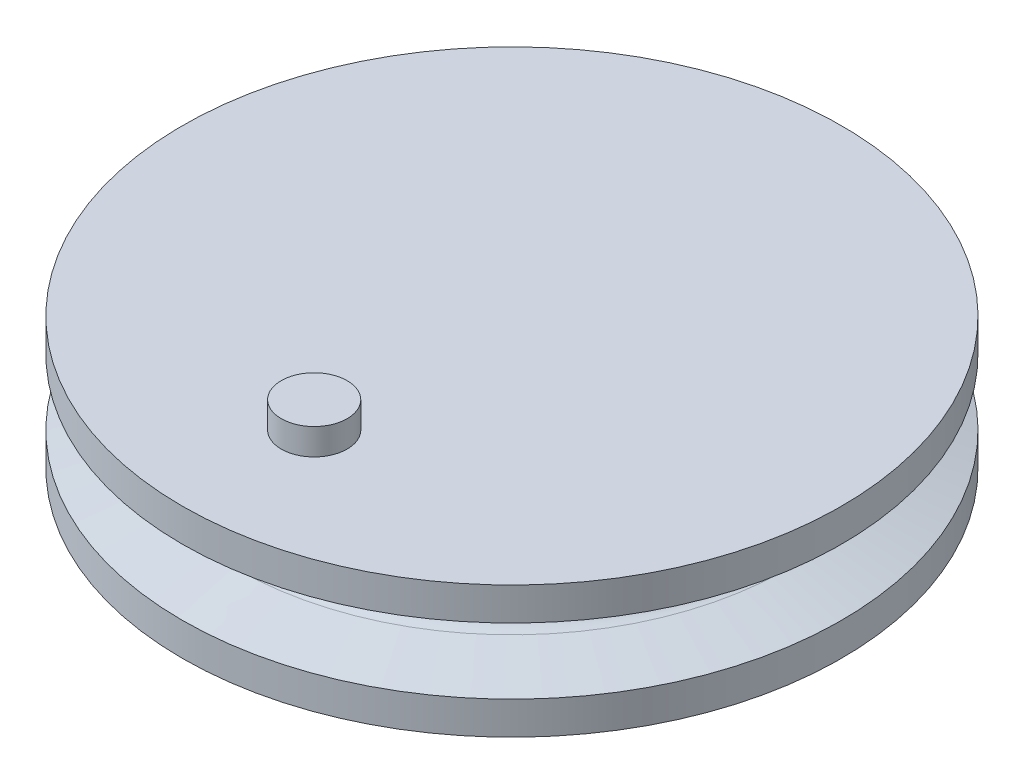
ISO-10303-21;
HEADER;
FILE_DESCRIPTION(('STEP AP214'),'2;1');
FILE_NAME('part.step','',(''),(''),'','','');
FILE_SCHEMA(('AUTOMOTIVE_DESIGN { 1 0 10303 214 1 1 1 1 }'));
ENDSEC;
DATA;
#1=APPLICATION_CONTEXT('core data for automotive mechanical design processes');
#2=APPLICATION_PROTOCOL_DEFINITION('international standard','automotive_design',2000,#1);
#3=PRODUCT_CONTEXT('',#1,'mechanical');
#4=PRODUCT('Part','Part','',(#3));
#5=PRODUCT_RELATED_PRODUCT_CATEGORY('part','',(#4));
#6=PRODUCT_DEFINITION_FORMATION('','',#4);
#7=PRODUCT_DEFINITION_CONTEXT('part definition',#1,'design');
#8=PRODUCT_DEFINITION('design','',#6,#7);
#9=PRODUCT_DEFINITION_SHAPE('','',#8);
#10=(LENGTH_UNIT() NAMED_UNIT(*) SI_UNIT(.MILLI.,.METRE.));
#11=(NAMED_UNIT(*) PLANE_ANGLE_UNIT() SI_UNIT($,.RADIAN.));
#12=(NAMED_UNIT(*) SI_UNIT($,.STERADIAN.) SOLID_ANGLE_UNIT());
#13=UNCERTAINTY_MEASURE_WITH_UNIT(LENGTH_MEASURE(1.E-05),#10,'distance_accuracy_value','');
#14=(GEOMETRIC_REPRESENTATION_CONTEXT(3) GLOBAL_UNCERTAINTY_ASSIGNED_CONTEXT((#13)) GLOBAL_UNIT_ASSIGNED_CONTEXT((#10,
#11,#12)) REPRESENTATION_CONTEXT('',''));
#15=CARTESIAN_POINT('',(0.,0.,0.));
#16=DIRECTION('',(0.,0.,1.));
#17=DIRECTION('',(1.,0.,0.));
#18=AXIS2_PLACEMENT_3D('',#15,#16,#17);
#19=CARTESIAN_POINT('',(0.,0.,0.));
#20=DIRECTION('',(0.,1.,0.));
#21=DIRECTION('',(0.,0.,1.));
#22=AXIS2_PLACEMENT_3D('',#19,#20,#21);
#23=PLANE('',#22);
#24=CARTESIAN_POINT('',(0.,0.,0.));
#25=DIRECTION('',(0.,-1.,0.));
#26=DIRECTION('',(0.,0.,-1.));
#27=AXIS2_PLACEMENT_3D('',#24,#25,#26);
#28=CIRCLE('',#27,2.5);
#29=CARTESIAN_POINT('',(0.,0.,-2.5));
#30=VERTEX_POINT('',#29);
#31=EDGE_CURVE('E71',#30,#30,#28,.T.);
#32=ORIENTED_EDGE('',*,*,#31,.F.);
#33=EDGE_LOOP('',(#32));
#34=FACE_BOUND('',#33,.T.);
#35=CARTESIAN_POINT('',(0.,0.,0.));
#36=DIRECTION('',(0.,1.,0.));
#37=DIRECTION('',(0.,0.,1.));
#38=AXIS2_PLACEMENT_3D('',#35,#36,#37);
#39=CIRCLE('',#38,25.);
#40=CARTESIAN_POINT('',(0.,0.,25.));
#41=VERTEX_POINT('',#40);
#42=EDGE_CURVE('E10',#41,#41,#39,.T.);
#43=ORIENTED_EDGE('',*,*,#42,.F.);
#44=EDGE_LOOP('',(#43));
#45=FACE_BOUND('',#44,.T.);
#46=ADVANCED_FACE('F39',(#34,#45),#23,.F.);
#47=CARTESIAN_POINT('',(0.,5.,0.));
#48=DIRECTION('',(0.,1.,0.));
#49=DIRECTION('',(0.,0.,1.));
#50=AXIS2_PLACEMENT_3D('',#47,#48,#49);
#51=TOROIDAL_SURFACE('',#50,21.25,1.25);
#52=CARTESIAN_POINT('',(0.,6.19156777359743,0.));
#53=DIRECTION('',(0.,1.,0.));
#54=DIRECTION('',(0.,0.,1.));
#55=AXIS2_PLACEMENT_3D('',#52,#53,#54);
#56=CIRCLE('',#55,20.8722881509351);
#57=CARTESIAN_POINT('',(0.,6.19156777359743,20.8722881509351));
#58=VERTEX_POINT('',#57);
#59=EDGE_CURVE('E56',#58,#58,#56,.T.);
#60=ORIENTED_EDGE('',*,*,#59,.F.);
#61=EDGE_LOOP('',(#60));
#62=FACE_BOUND('',#61,.T.);
#63=CARTESIAN_POINT('',(0.,3.80843222640257,0.));
#64=DIRECTION('',(0.,1.,0.));
#65=DIRECTION('',(0.,0.,1.));
#66=AXIS2_PLACEMENT_3D('',#63,#64,#65);
#67=CIRCLE('',#66,20.8722881509351);
#68=CARTESIAN_POINT('',(0.,3.80843222640257,20.8722881509351));
#69=VERTEX_POINT('',#68);
#70=EDGE_CURVE('E51',#69,#69,#67,.T.);
#71=ORIENTED_EDGE('',*,*,#70,.T.);
#72=EDGE_LOOP('',(#71));
#73=FACE_BOUND('',#72,.T.);
#74=ADVANCED_FACE('F115',(#62,#73),#51,.F.);
#75=CARTESIAN_POINT('',(0.,10.,0.));
#76=DIRECTION('',(0.,1.,0.));
#77=DIRECTION('',(0.,0.,1.));
#78=AXIS2_PLACEMENT_3D('',#75,#76,#77);
#79=CYLINDRICAL_SURFACE('',#78,25.);
#80=CARTESIAN_POINT('',(0.,2.5,0.));
#81=DIRECTION('',(0.,1.,0.));
#82=DIRECTION('',(0.,0.,1.));
#83=AXIS2_PLACEMENT_3D('',#80,#81,#82);
#84=CIRCLE('',#83,25.);
#85=CARTESIAN_POINT('',(0.,2.5,25.));
#86=VERTEX_POINT('',#85);
#87=EDGE_CURVE('E46',#86,#86,#84,.T.);
#88=ORIENTED_EDGE('',*,*,#87,.F.);
#89=EDGE_LOOP('',(#88));
#90=FACE_BOUND('',#89,.T.);
#91=ORIENTED_EDGE('',*,*,#42,.T.);
#92=EDGE_LOOP('',(#91));
#93=FACE_BOUND('',#92,.T.);
#94=ADVANCED_FACE('F118',(#90,#93),#79,.T.);
#95=CARTESIAN_POINT('',(0.,2.5,0.));
#96=DIRECTION('',(0.,-1.,0.));
#97=DIRECTION('',(0.,0.,-1.));
#98=AXIS2_PLACEMENT_3D('',#95,#96,#97);
#99=CONICAL_SURFACE('',#98,25.,1.26382862475014);
#100=ORIENTED_EDGE('',*,*,#70,.F.);
#101=EDGE_LOOP('',(#100));
#102=FACE_BOUND('',#101,.T.);
#103=ORIENTED_EDGE('',*,*,#87,.T.);
#104=EDGE_LOOP('',(#103));
#105=FACE_BOUND('',#104,.T.);
#106=ADVANCED_FACE('F111',(#102,#105),#99,.T.);
#107=CARTESIAN_POINT('',(0.,6.19156777359743,0.));
#108=DIRECTION('',(0.,1.,0.));
#109=DIRECTION('',(0.,0.,1.));
#110=AXIS2_PLACEMENT_3D('',#107,#108,#109);
#111=CONICAL_SURFACE('',#110,20.8722881509351,1.26382862475014);
#112=CARTESIAN_POINT('',(0.,7.50000000000001,0.));
#113=DIRECTION('',(0.,1.,0.));
#114=DIRECTION('',(0.,0.,1.));
#115=AXIS2_PLACEMENT_3D('',#112,#113,#114);
#116=CIRCLE('',#115,25.);
#117=CARTESIAN_POINT('',(0.,7.50000000000001,25.));
#118=VERTEX_POINT('',#117);
#119=EDGE_CURVE('E62',#118,#118,#116,.T.);
#120=ORIENTED_EDGE('',*,*,#119,.F.);
#121=EDGE_LOOP('',(#120));
#122=FACE_BOUND('',#121,.T.);
#123=ORIENTED_EDGE('',*,*,#59,.T.);
#124=EDGE_LOOP('',(#123));
#125=FACE_BOUND('',#124,.T.);
#126=ADVANCED_FACE('F105',(#122,#125),#111,.T.);
#127=CARTESIAN_POINT('',(0.,10.,0.));
#128=DIRECTION('',(0.,1.,0.));
#129=DIRECTION('',(0.,0.,1.));
#130=AXIS2_PLACEMENT_3D('',#127,#128,#129);
#131=CYLINDRICAL_SURFACE('',#130,25.);
#132=CARTESIAN_POINT('',(0.,10.,0.));
#133=DIRECTION('',(0.,1.,0.));
#134=DIRECTION('',(0.,0.,1.));
#135=AXIS2_PLACEMENT_3D('',#132,#133,#134);
#136=CIRCLE('',#135,25.);
#137=CARTESIAN_POINT('',(0.,10.,25.));
#138=VERTEX_POINT('',#137);
#139=EDGE_CURVE('E66',#138,#138,#136,.T.);
#140=ORIENTED_EDGE('',*,*,#139,.F.);
#141=EDGE_LOOP('',(#140));
#142=FACE_BOUND('',#141,.T.);
#143=ORIENTED_EDGE('',*,*,#119,.T.);
#144=EDGE_LOOP('',(#143));
#145=FACE_BOUND('',#144,.T.);
#146=ADVANCED_FACE('F100',(#142,#145),#131,.T.);
#147=CARTESIAN_POINT('',(0.,10.,0.));
#148=DIRECTION('',(0.,1.,0.));
#149=DIRECTION('',(0.,0.,1.));
#150=AXIS2_PLACEMENT_3D('',#147,#148,#149);
#151=PLANE('',#150);
#152=CARTESIAN_POINT('',(0.,10.,15.));
#153=DIRECTION('',(0.,1.,0.));
#154=DIRECTION('',(0.,0.,1.));
#155=AXIS2_PLACEMENT_3D('',#152,#153,#154);
#156=CIRCLE('',#155,2.5);
#157=CARTESIAN_POINT('',(0.,10.,17.5));
#158=VERTEX_POINT('',#157);
#159=EDGE_CURVE('E79',#158,#158,#156,.T.);
#160=ORIENTED_EDGE('',*,*,#159,.F.);
#161=EDGE_LOOP('',(#160));
#162=FACE_BOUND('',#161,.T.);
#163=ORIENTED_EDGE('',*,*,#139,.T.);
#164=EDGE_LOOP('',(#163));
#165=FACE_BOUND('',#164,.T.);
#166=ADVANCED_FACE('F96',(#162,#165),#151,.T.);
#167=CARTESIAN_POINT('',(0.,5.,0.));
#168=DIRECTION('',(0.,-1.,0.));
#169=DIRECTION('',(0.,0.,-1.));
#170=AXIS2_PLACEMENT_3D('',#167,#168,#169);
#171=CYLINDRICAL_SURFACE('',#170,2.5);
#172=CARTESIAN_POINT('',(0.,5.,0.));
#173=DIRECTION('',(0.,-1.,0.));
#174=DIRECTION('',(0.,0.,-1.));
#175=AXIS2_PLACEMENT_3D('',#172,#173,#174);
#176=CIRCLE('',#175,2.5);
#177=CARTESIAN_POINT('',(0.,5.,-2.5));
#178=VERTEX_POINT('',#177);
#179=EDGE_CURVE('E70',#178,#178,#176,.T.);
#180=ORIENTED_EDGE('',*,*,#179,.F.);
#181=EDGE_LOOP('',(#180));
#182=FACE_BOUND('',#181,.T.);
#183=ORIENTED_EDGE('',*,*,#31,.T.);
#184=EDGE_LOOP('',(#183));
#185=FACE_BOUND('',#184,.T.);
#186=ADVANCED_FACE('F99',(#182,#185),#171,.F.);
#187=CARTESIAN_POINT('',(0.,5.,0.));
#188=DIRECTION('',(0.,-1.,0.));
#189=DIRECTION('',(0.,0.,-1.));
#190=AXIS2_PLACEMENT_3D('',#187,#188,#189);
#191=PLANE('',#190);
#192=ORIENTED_EDGE('',*,*,#179,.T.);
#193=EDGE_LOOP('',(#192));
#194=FACE_BOUND('',#193,.T.);
#195=ADVANCED_FACE('F92',(#194),#191,.T.);
#196=CARTESIAN_POINT('',(0.,12.,15.));
#197=DIRECTION('',(0.,-1.,0.));
#198=DIRECTION('',(0.,0.,-1.));
#199=AXIS2_PLACEMENT_3D('',#196,#197,#198);
#200=CYLINDRICAL_SURFACE('',#199,2.5);
#201=CARTESIAN_POINT('',(0.,12.,15.));
#202=DIRECTION('',(0.,1.,0.));
#203=DIRECTION('',(0.,0.,1.));
#204=AXIS2_PLACEMENT_3D('',#201,#202,#203);
#205=CIRCLE('',#204,2.5);
#206=CARTESIAN_POINT('',(0.,12.,17.5));
#207=VERTEX_POINT('',#206);
#208=EDGE_CURVE('E75',#207,#207,#205,.T.);
#209=ORIENTED_EDGE('',*,*,#208,.F.);
#210=EDGE_LOOP('',(#209));
#211=FACE_BOUND('',#210,.T.);
#212=ORIENTED_EDGE('',*,*,#159,.T.);
#213=EDGE_LOOP('',(#212));
#214=FACE_BOUND('',#213,.T.);
#215=ADVANCED_FACE('F89',(#211,#214),#200,.T.);
#216=CARTESIAN_POINT('',(0.,12.,15.));
#217=DIRECTION('',(0.,1.,0.));
#218=DIRECTION('',(0.,0.,1.));
#219=AXIS2_PLACEMENT_3D('',#216,#217,#218);
#220=PLANE('',#219);
#221=ORIENTED_EDGE('',*,*,#208,.T.);
#222=EDGE_LOOP('',(#221));
#223=FACE_BOUND('',#222,.T.);
#224=ADVANCED_FACE('F87',(#223),#220,.T.);
#225=CLOSED_SHELL('',(#46,#74,#94,#106,#126,#146,#166,#186,#195,#215,#224));
#226=MANIFOLD_SOLID_BREP('B2',#225);
#227=ADVANCED_BREP_SHAPE_REPRESENTATION('',(#18,#226),#14);
#228=SHAPE_DEFINITION_REPRESENTATION(#9,#227);
ENDSEC;
END-ISO-10303-21;
